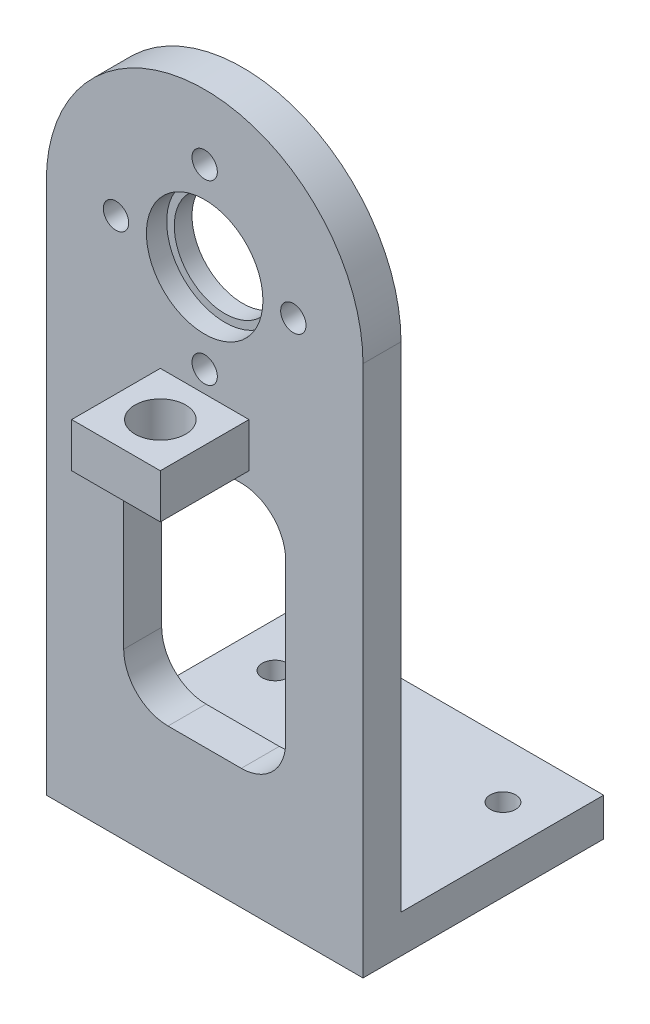
ISO-10303-21;
HEADER;
FILE_DESCRIPTION(('STEP AP214'),'2;1');
FILE_NAME('part.step','',(''),(''),'','','');
FILE_SCHEMA(('AUTOMOTIVE_DESIGN { 1 0 10303 214 1 1 1 1 }'));
ENDSEC;
DATA;
#1=APPLICATION_CONTEXT('core data for automotive mechanical design processes');
#2=APPLICATION_PROTOCOL_DEFINITION('international standard','automotive_design',2000,#1);
#3=PRODUCT_CONTEXT('',#1,'mechanical');
#4=PRODUCT('Part','Part','',(#3));
#5=PRODUCT_RELATED_PRODUCT_CATEGORY('part','',(#4));
#6=PRODUCT_DEFINITION_FORMATION('','',#4);
#7=PRODUCT_DEFINITION_CONTEXT('part definition',#1,'design');
#8=PRODUCT_DEFINITION('design','',#6,#7);
#9=PRODUCT_DEFINITION_SHAPE('','',#8);
#10=(LENGTH_UNIT() NAMED_UNIT(*) SI_UNIT(.MILLI.,.METRE.));
#11=(NAMED_UNIT(*) PLANE_ANGLE_UNIT() SI_UNIT($,.RADIAN.));
#12=(NAMED_UNIT(*) SI_UNIT($,.STERADIAN.) SOLID_ANGLE_UNIT());
#13=UNCERTAINTY_MEASURE_WITH_UNIT(LENGTH_MEASURE(1.E-05),#10,'distance_accuracy_value','');
#14=(GEOMETRIC_REPRESENTATION_CONTEXT(3) GLOBAL_UNCERTAINTY_ASSIGNED_CONTEXT((#13)) GLOBAL_UNIT_ASSIGNED_CONTEXT((#10,
#11,#12)) REPRESENTATION_CONTEXT('',''));
#15=CARTESIAN_POINT('',(0.,0.,0.));
#16=DIRECTION('',(0.,0.,1.));
#17=DIRECTION('',(1.,0.,0.));
#18=AXIS2_PLACEMENT_3D('',#15,#16,#17);
#19=CARTESIAN_POINT('',(0.,0.,3.));
#20=DIRECTION('',(0.,0.,1.));
#21=DIRECTION('',(1.,0.,0.));
#22=AXIS2_PLACEMENT_3D('',#19,#20,#21);
#23=PLANE('',#22);
#24=DIRECTION('',(1.,0.,0.));
#25=VECTOR('',#24,1.);
#26=CARTESIAN_POINT('',(0.,-14.5645587767016,3.));
#27=LINE('',#26,#25);
#28=CARTESIAN_POINT('',(-12.5,-14.5645587767016,3.));
#29=VERTEX_POINT('',#28);
#30=CARTESIAN_POINT('',(12.5,-14.5645587767016,3.));
#31=VERTEX_POINT('',#30);
#32=EDGE_CURVE('E293',#29,#31,#27,.T.);
#33=ORIENTED_EDGE('',*,*,#32,.T.);
#34=DIRECTION('',(0.,-1.,0.));
#35=VECTOR('',#34,1.);
#36=CARTESIAN_POINT('',(12.5,0.,3.));
#37=LINE('',#36,#35);
#38=CARTESIAN_POINT('',(12.5,27.4354412232984,3.));
#39=VERTEX_POINT('',#38);
#40=EDGE_CURVE('E286',#39,#31,#37,.T.);
#41=ORIENTED_EDGE('',*,*,#40,.F.);
#42=CARTESIAN_POINT('',(0.,27.4354412232984,3.));
#43=DIRECTION('',(0.,0.,1.));
#44=DIRECTION('',(1.,0.,0.));
#45=AXIS2_PLACEMENT_3D('',#42,#43,#44);
#46=CIRCLE('',#45,12.5);
#47=CARTESIAN_POINT('',(-12.5,27.4354412232984,3.));
#48=VERTEX_POINT('',#47);
#49=EDGE_CURVE('E288',#39,#48,#46,.T.);
#50=ORIENTED_EDGE('',*,*,#49,.T.);
#51=DIRECTION('',(0.,-1.,0.));
#52=VECTOR('',#51,1.);
#53=CARTESIAN_POINT('',(-12.5,0.,3.));
#54=LINE('',#53,#52);
#55=EDGE_CURVE('E291',#48,#29,#54,.T.);
#56=ORIENTED_EDGE('',*,*,#55,.T.);
#57=EDGE_LOOP('',(#33,#41,#50,#56));
#58=FACE_BOUND('',#57,.T.);
#59=CARTESIAN_POINT('',(0.,27.8020491594206,3.));
#60=DIRECTION('',(0.,0.,1.));
#61=DIRECTION('',(1.,0.,0.));
#62=AXIS2_PLACEMENT_3D('',#59,#60,#61);
#63=CIRCLE('',#62,4.6);
#64=CARTESIAN_POINT('',(4.6,27.8020491594206,3.));
#65=VERTEX_POINT('',#64);
#66=EDGE_CURVE('E249',#65,#65,#63,.T.);
#67=ORIENTED_EDGE('',*,*,#66,.F.);
#68=EDGE_LOOP('',(#67));
#69=FACE_BOUND('',#68,.T.);
#70=CARTESIAN_POINT('',(0.,20.8020491594206,3.));
#71=DIRECTION('',(0.,0.,1.));
#72=DIRECTION('',(1.,0.,0.));
#73=AXIS2_PLACEMENT_3D('',#70,#71,#72);
#74=CIRCLE('',#73,1.);
#75=CARTESIAN_POINT('',(1.,20.8020491594206,3.));
#76=VERTEX_POINT('',#75);
#77=EDGE_CURVE('E262',#76,#76,#74,.T.);
#78=ORIENTED_EDGE('',*,*,#77,.F.);
#79=EDGE_LOOP('',(#78));
#80=FACE_BOUND('',#79,.T.);
#81=CARTESIAN_POINT('',(-7.,27.8020491594206,3.));
#82=DIRECTION('',(0.,0.,1.));
#83=DIRECTION('',(1.,0.,0.));
#84=AXIS2_PLACEMENT_3D('',#81,#82,#83);
#85=CIRCLE('',#84,1.);
#86=CARTESIAN_POINT('',(-6.,27.8020491594206,3.));
#87=VERTEX_POINT('',#86);
#88=EDGE_CURVE('E275',#87,#87,#85,.T.);
#89=ORIENTED_EDGE('',*,*,#88,.F.);
#90=EDGE_LOOP('',(#89));
#91=FACE_BOUND('',#90,.T.);
#92=CARTESIAN_POINT('',(0.,34.8020491594206,3.));
#93=DIRECTION('',(0.,0.,1.));
#94=DIRECTION('',(1.,0.,0.));
#95=AXIS2_PLACEMENT_3D('',#92,#93,#94);
#96=CIRCLE('',#95,1.);
#97=CARTESIAN_POINT('',(1.,34.8020491594206,3.));
#98=VERTEX_POINT('',#97);
#99=EDGE_CURVE('E268',#98,#98,#96,.T.);
#100=ORIENTED_EDGE('',*,*,#99,.F.);
#101=EDGE_LOOP('',(#100));
#102=FACE_BOUND('',#101,.T.);
#103=CARTESIAN_POINT('',(7.,27.8020491594206,3.));
#104=DIRECTION('',(0.,0.,1.));
#105=DIRECTION('',(1.,0.,0.));
#106=AXIS2_PLACEMENT_3D('',#103,#104,#105);
#107=CIRCLE('',#106,1.);
#108=CARTESIAN_POINT('',(8.,27.8020491594206,3.));
#109=VERTEX_POINT('',#108);
#110=EDGE_CURVE('E271',#109,#109,#107,.T.);
#111=ORIENTED_EDGE('',*,*,#110,.F.);
#112=EDGE_LOOP('',(#111));
#113=FACE_BOUND('',#112,.T.);
#114=DIRECTION('',(0.,-1.,0.));
#115=VECTOR('',#114,1.);
#116=CARTESIAN_POINT('',(-6.39192660681687,0.,3.));
#117=LINE('',#116,#115);
#118=CARTESIAN_POINT('',(-6.39192660681687,10.9669786390167,3.));
#119=VERTEX_POINT('',#118);
#120=CARTESIAN_POINT('',(-6.39192660681687,-1.53302136098327,3.));
#121=VERTEX_POINT('',#120);
#122=EDGE_CURVE('E205',#119,#121,#117,.T.);
#123=ORIENTED_EDGE('',*,*,#122,.F.);
#124=CARTESIAN_POINT('',(-2.89192660681687,10.9669786390167,3.));
#125=DIRECTION('',(0.,0.,1.));
#126=DIRECTION('',(1.,0.,0.));
#127=AXIS2_PLACEMENT_3D('',#124,#125,#126);
#128=CIRCLE('',#127,3.5);
#129=CARTESIAN_POINT('',(-2.89192660681687,14.4669786390167,3.));
#130=VERTEX_POINT('',#129);
#131=EDGE_CURVE('E53',#119,#130,#128,.F.);
#132=ORIENTED_EDGE('',*,*,#131,.T.);
#133=DIRECTION('',(1.,0.,0.));
#134=VECTOR('',#133,1.);
#135=CARTESIAN_POINT('',(0.,14.4669786390167,3.));
#136=LINE('',#135,#134);
#137=CARTESIAN_POINT('',(2.89192660681686,14.4669786390167,3.));
#138=VERTEX_POINT('',#137);
#139=EDGE_CURVE('E198',#130,#138,#136,.T.);
#140=ORIENTED_EDGE('',*,*,#139,.T.);
#141=CARTESIAN_POINT('',(2.89192660681686,10.9669786390167,3.));
#142=DIRECTION('',(0.,0.,1.));
#143=DIRECTION('',(1.,0.,0.));
#144=AXIS2_PLACEMENT_3D('',#141,#142,#143);
#145=CIRCLE('',#144,3.5);
#146=CARTESIAN_POINT('',(6.39192660681686,10.9669786390167,3.));
#147=VERTEX_POINT('',#146);
#148=EDGE_CURVE('E68',#138,#147,#145,.F.);
#149=ORIENTED_EDGE('',*,*,#148,.T.);
#150=DIRECTION('',(0.,-1.,0.));
#151=VECTOR('',#150,1.);
#152=CARTESIAN_POINT('',(6.39192660681687,0.,3.));
#153=LINE('',#152,#151);
#154=CARTESIAN_POINT('',(6.39192660681687,-1.53302136098327,3.));
#155=VERTEX_POINT('',#154);
#156=EDGE_CURVE('E195',#147,#155,#153,.T.);
#157=ORIENTED_EDGE('',*,*,#156,.T.);
#158=CARTESIAN_POINT('',(2.89192660681687,-1.53302136098327,3.));
#159=DIRECTION('',(0.,0.,1.));
#160=DIRECTION('',(1.,0.,0.));
#161=AXIS2_PLACEMENT_3D('',#158,#159,#160);
#162=CIRCLE('',#161,3.5);
#163=CARTESIAN_POINT('',(2.89192660681687,-5.03302136098327,3.));
#164=VERTEX_POINT('',#163);
#165=EDGE_CURVE('E338',#155,#164,#162,.F.);
#166=ORIENTED_EDGE('',*,*,#165,.T.);
#167=DIRECTION('',(1.,0.,0.));
#168=VECTOR('',#167,1.);
#169=CARTESIAN_POINT('',(0.,-5.03302136098327,3.));
#170=LINE('',#169,#168);
#171=CARTESIAN_POINT('',(-2.89192660681687,-5.03302136098327,3.));
#172=VERTEX_POINT('',#171);
#173=EDGE_CURVE('E208',#172,#164,#170,.T.);
#174=ORIENTED_EDGE('',*,*,#173,.F.);
#175=CARTESIAN_POINT('',(-2.89192660681687,-1.53302136098327,3.));
#176=DIRECTION('',(0.,0.,1.));
#177=DIRECTION('',(1.,0.,0.));
#178=AXIS2_PLACEMENT_3D('',#175,#176,#177);
#179=CIRCLE('',#178,3.5);
#180=EDGE_CURVE('E334',#172,#121,#179,.F.);
#181=ORIENTED_EDGE('',*,*,#180,.T.);
#182=EDGE_LOOP('',(#123,#132,#140,#149,#157,#166,#174,#181));
#183=FACE_BOUND('',#182,.T.);
#184=DIRECTION('',(-1.,0.,0.));
#185=VECTOR('',#184,1.);
#186=CARTESIAN_POINT('',(-3.5,19.1154412232984,3.));
#187=LINE('',#186,#185);
#188=CARTESIAN_POINT('',(3.5,19.1154412232984,3.));
#189=VERTEX_POINT('',#188);
#190=CARTESIAN_POINT('',(-3.5,19.1154412232984,3.));
#191=VERTEX_POINT('',#190);
#192=EDGE_CURVE('E685',#189,#191,#187,.T.);
#193=ORIENTED_EDGE('',*,*,#192,.F.);
#194=DIRECTION('',(0.,1.,0.));
#195=VECTOR('',#194,1.);
#196=CARTESIAN_POINT('',(3.5,15.6154412232984,3.));
#197=LINE('',#196,#195);
#198=CARTESIAN_POINT('',(3.5,15.6154412232984,3.));
#199=VERTEX_POINT('',#198);
#200=EDGE_CURVE('E193',#199,#189,#197,.T.);
#201=ORIENTED_EDGE('',*,*,#200,.F.);
#202=DIRECTION('',(1.,0.,0.));
#203=VECTOR('',#202,1.);
#204=CARTESIAN_POINT('',(-3.5,15.6154412232984,3.));
#205=LINE('',#204,#203);
#206=CARTESIAN_POINT('',(-3.5,15.6154412232984,3.));
#207=VERTEX_POINT('',#206);
#208=EDGE_CURVE('E189',#207,#199,#205,.T.);
#209=ORIENTED_EDGE('',*,*,#208,.F.);
#210=DIRECTION('',(0.,-1.,0.));
#211=VECTOR('',#210,1.);
#212=CARTESIAN_POINT('',(-3.5,15.6154412232984,3.));
#213=LINE('',#212,#211);
#214=EDGE_CURVE('E693',#191,#207,#213,.T.);
#215=ORIENTED_EDGE('',*,*,#214,.F.);
#216=EDGE_LOOP('',(#193,#201,#209,#215));
#217=FACE_BOUND('',#216,.T.);
#218=ADVANCED_FACE('F44',(#58,#69,#80,#91,#102,#113,#183,#217),#23,.T.);
#219=CARTESIAN_POINT('',(0.,0.,0.));
#220=DIRECTION('',(0.,0.,1.));
#221=DIRECTION('',(1.,0.,0.));
#222=AXIS2_PLACEMENT_3D('',#219,#220,#221);
#223=PLANE('',#222);
#224=DIRECTION('',(1.,0.,0.));
#225=VECTOR('',#224,1.);
#226=CARTESIAN_POINT('',(0.,-11.5645587767016,0.));
#227=LINE('',#226,#225);
#228=CARTESIAN_POINT('',(-12.5,-11.5645587767016,0.));
#229=VERTEX_POINT('',#228);
#230=CARTESIAN_POINT('',(12.5,-11.5645587767016,0.));
#231=VERTEX_POINT('',#230);
#232=EDGE_CURVE('E311',#229,#231,#227,.T.);
#233=ORIENTED_EDGE('',*,*,#232,.F.);
#234=DIRECTION('',(0.,-1.,0.));
#235=VECTOR('',#234,1.);
#236=CARTESIAN_POINT('',(-12.5,0.,0.));
#237=LINE('',#236,#235);
#238=CARTESIAN_POINT('',(-12.5,27.4354412232984,0.));
#239=VERTEX_POINT('',#238);
#240=EDGE_CURVE('E289',#239,#229,#237,.T.);
#241=ORIENTED_EDGE('',*,*,#240,.F.);
#242=CARTESIAN_POINT('',(0.,27.4354412232984,0.));
#243=DIRECTION('',(0.,0.,1.));
#244=DIRECTION('',(1.,0.,0.));
#245=AXIS2_PLACEMENT_3D('',#242,#243,#244);
#246=CIRCLE('',#245,12.5);
#247=CARTESIAN_POINT('',(12.5,27.4354412232984,0.));
#248=VERTEX_POINT('',#247);
#249=EDGE_CURVE('E299',#248,#239,#246,.T.);
#250=ORIENTED_EDGE('',*,*,#249,.F.);
#251=DIRECTION('',(0.,-1.,0.));
#252=VECTOR('',#251,1.);
#253=CARTESIAN_POINT('',(12.5,0.,0.));
#254=LINE('',#253,#252);
#255=EDGE_CURVE('E283',#248,#231,#254,.T.);
#256=ORIENTED_EDGE('',*,*,#255,.T.);
#257=EDGE_LOOP('',(#233,#241,#250,#256));
#258=FACE_BOUND('',#257,.T.);
#259=CARTESIAN_POINT('',(0.,20.8020491594206,0.));
#260=DIRECTION('',(0.,0.,1.));
#261=DIRECTION('',(1.,0.,0.));
#262=AXIS2_PLACEMENT_3D('',#259,#260,#261);
#263=CIRCLE('',#262,1.);
#264=CARTESIAN_POINT('',(1.,20.8020491594206,0.));
#265=VERTEX_POINT('',#264);
#266=EDGE_CURVE('E265',#265,#265,#263,.T.);
#267=ORIENTED_EDGE('',*,*,#266,.T.);
#268=EDGE_LOOP('',(#267));
#269=FACE_BOUND('',#268,.T.);
#270=CARTESIAN_POINT('',(0.,27.8020491594206,0.));
#271=DIRECTION('',(0.,0.,1.));
#272=DIRECTION('',(1.,0.,0.));
#273=AXIS2_PLACEMENT_3D('',#270,#271,#272);
#274=CIRCLE('',#273,4.);
#275=CARTESIAN_POINT('',(4.,27.8020491594206,0.));
#276=VERTEX_POINT('',#275);
#277=EDGE_CURVE('E258',#276,#276,#274,.T.);
#278=ORIENTED_EDGE('',*,*,#277,.T.);
#279=EDGE_LOOP('',(#278));
#280=FACE_BOUND('',#279,.T.);
#281=CARTESIAN_POINT('',(-7.,27.8020491594206,0.));
#282=DIRECTION('',(0.,0.,1.));
#283=DIRECTION('',(1.,0.,0.));
#284=AXIS2_PLACEMENT_3D('',#281,#282,#283);
#285=CIRCLE('',#284,1.);
#286=CARTESIAN_POINT('',(-6.,27.8020491594206,0.));
#287=VERTEX_POINT('',#286);
#288=EDGE_CURVE('E261',#287,#287,#285,.T.);
#289=ORIENTED_EDGE('',*,*,#288,.T.);
#290=EDGE_LOOP('',(#289));
#291=FACE_BOUND('',#290,.T.);
#292=CARTESIAN_POINT('',(0.,34.8020491594206,0.));
#293=DIRECTION('',(0.,0.,1.));
#294=DIRECTION('',(1.,0.,0.));
#295=AXIS2_PLACEMENT_3D('',#292,#293,#294);
#296=CIRCLE('',#295,1.);
#297=CARTESIAN_POINT('',(1.,34.8020491594206,0.));
#298=VERTEX_POINT('',#297);
#299=EDGE_CURVE('E272',#298,#298,#296,.T.);
#300=ORIENTED_EDGE('',*,*,#299,.T.);
#301=EDGE_LOOP('',(#300));
#302=FACE_BOUND('',#301,.T.);
#303=CARTESIAN_POINT('',(7.,27.8020491594206,0.));
#304=DIRECTION('',(0.,0.,1.));
#305=DIRECTION('',(1.,0.,0.));
#306=AXIS2_PLACEMENT_3D('',#303,#304,#305);
#307=CIRCLE('',#306,1.);
#308=CARTESIAN_POINT('',(8.,27.8020491594206,0.));
#309=VERTEX_POINT('',#308);
#310=EDGE_CURVE('E280',#309,#309,#307,.T.);
#311=ORIENTED_EDGE('',*,*,#310,.T.);
#312=EDGE_LOOP('',(#311));
#313=FACE_BOUND('',#312,.T.);
#314=DIRECTION('',(0.,-1.,0.));
#315=VECTOR('',#314,1.);
#316=CARTESIAN_POINT('',(6.39192660681687,0.,0.));
#317=LINE('',#316,#315);
#318=CARTESIAN_POINT('',(6.39192660681686,10.9669786390167,0.));
#319=VERTEX_POINT('',#318);
#320=CARTESIAN_POINT('',(6.39192660681687,-1.53302136098327,0.));
#321=VERTEX_POINT('',#320);
#322=EDGE_CURVE('E220',#319,#321,#317,.T.);
#323=ORIENTED_EDGE('',*,*,#322,.F.);
#324=CARTESIAN_POINT('',(2.89192660681686,10.9669786390167,0.));
#325=DIRECTION('',(0.,0.,1.));
#326=DIRECTION('',(1.,0.,0.));
#327=AXIS2_PLACEMENT_3D('',#324,#325,#326);
#328=CIRCLE('',#327,3.5);
#329=CARTESIAN_POINT('',(2.89192660681686,14.4669786390167,0.));
#330=VERTEX_POINT('',#329);
#331=EDGE_CURVE('E343',#319,#330,#328,.T.);
#332=ORIENTED_EDGE('',*,*,#331,.T.);
#333=DIRECTION('',(1.,0.,0.));
#334=VECTOR('',#333,1.);
#335=CARTESIAN_POINT('',(0.,14.4669786390167,0.));
#336=LINE('',#335,#334);
#337=CARTESIAN_POINT('',(-2.89192660681687,14.4669786390167,0.));
#338=VERTEX_POINT('',#337);
#339=EDGE_CURVE('E211',#338,#330,#336,.T.);
#340=ORIENTED_EDGE('',*,*,#339,.F.);
#341=CARTESIAN_POINT('',(-2.89192660681687,10.9669786390167,0.));
#342=DIRECTION('',(0.,0.,1.));
#343=DIRECTION('',(1.,0.,0.));
#344=AXIS2_PLACEMENT_3D('',#341,#342,#343);
#345=CIRCLE('',#344,3.5);
#346=CARTESIAN_POINT('',(-6.39192660681687,10.9669786390167,0.));
#347=VERTEX_POINT('',#346);
#348=EDGE_CURVE('E12',#338,#347,#345,.T.);
#349=ORIENTED_EDGE('',*,*,#348,.T.);
#350=DIRECTION('',(0.,-1.,0.));
#351=VECTOR('',#350,1.);
#352=CARTESIAN_POINT('',(-6.39192660681687,0.,0.));
#353=LINE('',#352,#351);
#354=CARTESIAN_POINT('',(-6.39192660681687,-1.53302136098327,0.));
#355=VERTEX_POINT('',#354);
#356=EDGE_CURVE('E214',#347,#355,#353,.T.);
#357=ORIENTED_EDGE('',*,*,#356,.T.);
#358=CARTESIAN_POINT('',(-2.89192660681687,-1.53302136098327,0.));
#359=DIRECTION('',(0.,0.,1.));
#360=DIRECTION('',(1.,0.,0.));
#361=AXIS2_PLACEMENT_3D('',#358,#359,#360);
#362=CIRCLE('',#361,3.5);
#363=CARTESIAN_POINT('',(-2.89192660681687,-5.03302136098327,0.));
#364=VERTEX_POINT('',#363);
#365=EDGE_CURVE('E336',#355,#364,#362,.T.);
#366=ORIENTED_EDGE('',*,*,#365,.T.);
#367=DIRECTION('',(1.,0.,0.));
#368=VECTOR('',#367,1.);
#369=CARTESIAN_POINT('',(0.,-5.03302136098327,0.));
#370=LINE('',#369,#368);
#371=CARTESIAN_POINT('',(2.89192660681687,-5.03302136098327,0.));
#372=VERTEX_POINT('',#371);
#373=EDGE_CURVE('E217',#364,#372,#370,.T.);
#374=ORIENTED_EDGE('',*,*,#373,.T.);
#375=CARTESIAN_POINT('',(2.89192660681687,-1.53302136098327,0.));
#376=DIRECTION('',(0.,0.,1.));
#377=DIRECTION('',(1.,0.,0.));
#378=AXIS2_PLACEMENT_3D('',#375,#376,#377);
#379=CIRCLE('',#378,3.5);
#380=EDGE_CURVE('E340',#372,#321,#379,.T.);
#381=ORIENTED_EDGE('',*,*,#380,.T.);
#382=EDGE_LOOP('',(#323,#332,#340,#349,#357,#366,#374,#381));
#383=FACE_BOUND('',#382,.T.);
#384=ADVANCED_FACE('F359',(#258,#269,#280,#291,#302,#313,#383),#223,.F.);
#385=CARTESIAN_POINT('',(0.,27.8020491594206,0.));
#386=DIRECTION('',(0.,0.,1.));
#387=DIRECTION('',(1.,0.,0.));
#388=AXIS2_PLACEMENT_3D('',#385,#386,#387);
#389=CYLINDRICAL_SURFACE('',#388,4.);
#390=ORIENTED_EDGE('',*,*,#277,.F.);
#391=EDGE_LOOP('',(#390));
#392=FACE_BOUND('',#391,.T.);
#393=CARTESIAN_POINT('',(0.,27.8020491594206,1.4));
#394=DIRECTION('',(0.,0.,1.));
#395=DIRECTION('',(1.,0.,0.));
#396=AXIS2_PLACEMENT_3D('',#393,#394,#395);
#397=CIRCLE('',#396,4.);
#398=CARTESIAN_POINT('',(4.,27.8020491594206,1.4));
#399=VERTEX_POINT('',#398);
#400=EDGE_CURVE('E255',#399,#399,#397,.F.);
#401=ORIENTED_EDGE('',*,*,#400,.F.);
#402=EDGE_LOOP('',(#401));
#403=FACE_BOUND('',#402,.T.);
#404=ADVANCED_FACE('F393',(#392,#403),#389,.F.);
#405=CARTESIAN_POINT('',(12.5,0.,3.));
#406=DIRECTION('',(1.,0.,0.));
#407=DIRECTION('',(0.,1.,0.));
#408=AXIS2_PLACEMENT_3D('',#405,#406,#407);
#409=PLANE('',#408);
#410=DIRECTION('',(0.,0.,1.));
#411=VECTOR('',#410,1.);
#412=CARTESIAN_POINT('',(12.5,-11.5645587767016,-16.));
#413=LINE('',#412,#411);
#414=CARTESIAN_POINT('',(12.5,-11.5645587767016,-16.));
#415=VERTEX_POINT('',#414);
#416=EDGE_CURVE('E246',#415,#231,#413,.T.);
#417=ORIENTED_EDGE('',*,*,#416,.T.);
#418=ORIENTED_EDGE('',*,*,#255,.F.);
#419=DIRECTION('',(0.,0.,-1.));
#420=VECTOR('',#419,1.);
#421=CARTESIAN_POINT('',(12.5,27.4354412232984,3.));
#422=LINE('',#421,#420);
#423=EDGE_CURVE('E309',#39,#248,#422,.T.);
#424=ORIENTED_EDGE('',*,*,#423,.F.);
#425=ORIENTED_EDGE('',*,*,#40,.T.);
#426=DIRECTION('',(0.,0.,-1.));
#427=VECTOR('',#426,1.);
#428=CARTESIAN_POINT('',(12.5,-14.5645587767016,3.));
#429=LINE('',#428,#427);
#430=CARTESIAN_POINT('',(12.5,-14.5645587767016,-16.));
#431=VERTEX_POINT('',#430);
#432=EDGE_CURVE('E296',#31,#431,#429,.T.);
#433=ORIENTED_EDGE('',*,*,#432,.T.);
#434=DIRECTION('',(0.,1.,0.));
#435=VECTOR('',#434,1.);
#436=CARTESIAN_POINT('',(12.5,-14.5645587767016,-16.));
#437=LINE('',#436,#435);
#438=EDGE_CURVE('E241',#431,#415,#437,.T.);
#439=ORIENTED_EDGE('',*,*,#438,.T.);
#440=EDGE_LOOP('',(#417,#418,#424,#425,#433,#439));
#441=FACE_BOUND('',#440,.T.);
#442=ADVANCED_FACE('F412',(#441),#409,.T.);
#443=CARTESIAN_POINT('',(0.,27.4354412232984,3.));
#444=DIRECTION('',(0.,0.,-1.));
#445=DIRECTION('',(-1.,0.,0.));
#446=AXIS2_PLACEMENT_3D('',#443,#444,#445);
#447=CYLINDRICAL_SURFACE('',#446,12.5);
#448=ORIENTED_EDGE('',*,*,#249,.T.);
#449=DIRECTION('',(0.,0.,-1.));
#450=VECTOR('',#449,1.);
#451=CARTESIAN_POINT('',(-12.5,27.4354412232984,3.));
#452=LINE('',#451,#450);
#453=EDGE_CURVE('E306',#48,#239,#452,.T.);
#454=ORIENTED_EDGE('',*,*,#453,.F.);
#455=ORIENTED_EDGE('',*,*,#49,.F.);
#456=ORIENTED_EDGE('',*,*,#423,.T.);
#457=EDGE_LOOP('',(#448,#454,#455,#456));
#458=FACE_BOUND('',#457,.T.);
#459=ADVANCED_FACE('F408',(#458),#447,.T.);
#460=CARTESIAN_POINT('',(-12.5,0.,3.));
#461=DIRECTION('',(1.,0.,0.));
#462=DIRECTION('',(0.,1.,0.));
#463=AXIS2_PLACEMENT_3D('',#460,#461,#462);
#464=PLANE('',#463);
#465=DIRECTION('',(0.,0.,-1.));
#466=VECTOR('',#465,1.);
#467=CARTESIAN_POINT('',(-12.5,-14.5645587767016,3.));
#468=LINE('',#467,#466);
#469=CARTESIAN_POINT('',(-12.5,-14.5645587767016,-16.));
#470=VERTEX_POINT('',#469);
#471=EDGE_CURVE('E304',#29,#470,#468,.T.);
#472=ORIENTED_EDGE('',*,*,#471,.F.);
#473=ORIENTED_EDGE('',*,*,#55,.F.);
#474=ORIENTED_EDGE('',*,*,#453,.T.);
#475=ORIENTED_EDGE('',*,*,#240,.T.);
#476=DIRECTION('',(0.,0.,1.));
#477=VECTOR('',#476,1.);
#478=CARTESIAN_POINT('',(-12.5,-11.5645587767016,-16.));
#479=LINE('',#478,#477);
#480=CARTESIAN_POINT('',(-12.5,-11.5645587767016,-16.));
#481=VERTEX_POINT('',#480);
#482=EDGE_CURVE('E247',#481,#229,#479,.T.);
#483=ORIENTED_EDGE('',*,*,#482,.F.);
#484=DIRECTION('',(0.,-1.,0.));
#485=VECTOR('',#484,1.);
#486=CARTESIAN_POINT('',(-12.5,-11.5645587767016,-16.));
#487=LINE('',#486,#485);
#488=EDGE_CURVE('E235',#481,#470,#487,.T.);
#489=ORIENTED_EDGE('',*,*,#488,.T.);
#490=EDGE_LOOP('',(#472,#473,#474,#475,#483,#489));
#491=FACE_BOUND('',#490,.T.);
#492=ADVANCED_FACE('F404',(#491),#464,.F.);
#493=CARTESIAN_POINT('',(0.,-14.5645587767016,3.));
#494=DIRECTION('',(0.,1.,0.));
#495=DIRECTION('',(-1.,0.,0.));
#496=AXIS2_PLACEMENT_3D('',#493,#494,#495);
#497=PLANE('',#496);
#498=CARTESIAN_POINT('',(-9.,-14.5645587767016,-11.55));
#499=DIRECTION('',(0.,1.,0.));
#500=DIRECTION('',(-1.,0.,0.));
#501=AXIS2_PLACEMENT_3D('',#498,#499,#500);
#502=CIRCLE('',#501,0.999999999999999);
#503=CARTESIAN_POINT('',(-10.,-14.5645587767016,-11.55));
#504=VERTEX_POINT('',#503);
#505=EDGE_CURVE('E226',#504,#504,#502,.T.);
#506=ORIENTED_EDGE('',*,*,#505,.T.);
#507=EDGE_LOOP('',(#506));
#508=FACE_BOUND('',#507,.T.);
#509=CARTESIAN_POINT('',(9.,-14.5645587767016,-11.55));
#510=DIRECTION('',(0.,1.,0.));
#511=DIRECTION('',(-1.,0.,0.));
#512=AXIS2_PLACEMENT_3D('',#509,#510,#511);
#513=CIRCLE('',#512,1.);
#514=CARTESIAN_POINT('',(8.,-14.5645587767016,-11.55));
#515=VERTEX_POINT('',#514);
#516=EDGE_CURVE('E232',#515,#515,#513,.T.);
#517=ORIENTED_EDGE('',*,*,#516,.T.);
#518=EDGE_LOOP('',(#517));
#519=FACE_BOUND('',#518,.T.);
#520=ORIENTED_EDGE('',*,*,#471,.T.);
#521=DIRECTION('',(1.,0.,0.));
#522=VECTOR('',#521,1.);
#523=CARTESIAN_POINT('',(-12.5,-14.5645587767016,-16.));
#524=LINE('',#523,#522);
#525=EDGE_CURVE('E238',#470,#431,#524,.T.);
#526=ORIENTED_EDGE('',*,*,#525,.T.);
#527=ORIENTED_EDGE('',*,*,#432,.F.);
#528=ORIENTED_EDGE('',*,*,#32,.F.);
#529=EDGE_LOOP('',(#520,#526,#527,#528));
#530=FACE_BOUND('',#529,.T.);
#531=ADVANCED_FACE('F401',(#508,#519,#530),#497,.F.);
#532=CARTESIAN_POINT('',(7.,27.8020491594206,0.));
#533=DIRECTION('',(0.,0.,1.));
#534=DIRECTION('',(1.,0.,0.));
#535=AXIS2_PLACEMENT_3D('',#532,#533,#534);
#536=CYLINDRICAL_SURFACE('',#535,1.);
#537=ORIENTED_EDGE('',*,*,#310,.F.);
#538=EDGE_LOOP('',(#537));
#539=FACE_BOUND('',#538,.T.);
#540=ORIENTED_EDGE('',*,*,#110,.T.);
#541=EDGE_LOOP('',(#540));
#542=FACE_BOUND('',#541,.T.);
#543=ADVANCED_FACE('F398',(#539,#542),#536,.F.);
#544=CARTESIAN_POINT('',(0.,34.8020491594206,0.));
#545=DIRECTION('',(0.,0.,1.));
#546=DIRECTION('',(1.,0.,0.));
#547=AXIS2_PLACEMENT_3D('',#544,#545,#546);
#548=CYLINDRICAL_SURFACE('',#547,1.);
#549=ORIENTED_EDGE('',*,*,#299,.F.);
#550=EDGE_LOOP('',(#549));
#551=FACE_BOUND('',#550,.T.);
#552=ORIENTED_EDGE('',*,*,#99,.T.);
#553=EDGE_LOOP('',(#552));
#554=FACE_BOUND('',#553,.T.);
#555=ADVANCED_FACE('F462',(#551,#554),#548,.F.);
#556=CARTESIAN_POINT('',(-7.,27.8020491594206,0.));
#557=DIRECTION('',(0.,0.,1.));
#558=DIRECTION('',(1.,0.,0.));
#559=AXIS2_PLACEMENT_3D('',#556,#557,#558);
#560=CYLINDRICAL_SURFACE('',#559,1.);
#561=ORIENTED_EDGE('',*,*,#288,.F.);
#562=EDGE_LOOP('',(#561));
#563=FACE_BOUND('',#562,.T.);
#564=ORIENTED_EDGE('',*,*,#88,.T.);
#565=EDGE_LOOP('',(#564));
#566=FACE_BOUND('',#565,.T.);
#567=ADVANCED_FACE('F460',(#563,#566),#560,.F.);
#568=CARTESIAN_POINT('',(0.,20.8020491594206,0.));
#569=DIRECTION('',(0.,0.,1.));
#570=DIRECTION('',(1.,0.,0.));
#571=AXIS2_PLACEMENT_3D('',#568,#569,#570);
#572=CYLINDRICAL_SURFACE('',#571,1.);
#573=ORIENTED_EDGE('',*,*,#77,.T.);
#574=EDGE_LOOP('',(#573));
#575=FACE_BOUND('',#574,.T.);
#576=ORIENTED_EDGE('',*,*,#266,.F.);
#577=EDGE_LOOP('',(#576));
#578=FACE_BOUND('',#577,.T.);
#579=ADVANCED_FACE('F450',(#575,#578),#572,.F.);
#580=CARTESIAN_POINT('',(0.,27.8020491594206,1.4));
#581=DIRECTION('',(0.,0.,1.));
#582=DIRECTION('',(1.,0.,0.));
#583=AXIS2_PLACEMENT_3D('',#580,#581,#582);
#584=PLANE('',#583);
#585=CARTESIAN_POINT('',(0.,27.8020491594206,1.4));
#586=DIRECTION('',(0.,0.,1.));
#587=DIRECTION('',(1.,0.,0.));
#588=AXIS2_PLACEMENT_3D('',#585,#586,#587);
#589=CIRCLE('',#588,4.6);
#590=CARTESIAN_POINT('',(4.6,27.8020491594206,1.4));
#591=VERTEX_POINT('',#590);
#592=EDGE_CURVE('E252',#591,#591,#589,.T.);
#593=ORIENTED_EDGE('',*,*,#592,.T.);
#594=EDGE_LOOP('',(#593));
#595=FACE_BOUND('',#594,.T.);
#596=ORIENTED_EDGE('',*,*,#400,.T.);
#597=EDGE_LOOP('',(#596));
#598=FACE_BOUND('',#597,.T.);
#599=ADVANCED_FACE('F447',(#595,#598),#584,.T.);
#600=CARTESIAN_POINT('',(0.,27.8020491594206,1.4));
#601=DIRECTION('',(0.,0.,1.));
#602=DIRECTION('',(1.,0.,0.));
#603=AXIS2_PLACEMENT_3D('',#600,#601,#602);
#604=CYLINDRICAL_SURFACE('',#603,4.6);
#605=ORIENTED_EDGE('',*,*,#592,.F.);
#606=EDGE_LOOP('',(#605));
#607=FACE_BOUND('',#606,.T.);
#608=ORIENTED_EDGE('',*,*,#66,.T.);
#609=EDGE_LOOP('',(#608));
#610=FACE_BOUND('',#609,.T.);
#611=ADVANCED_FACE('F445',(#607,#610),#604,.F.);
#612=CARTESIAN_POINT('',(-12.5,-11.5645587767016,-16.));
#613=DIRECTION('',(0.,-1.,0.));
#614=DIRECTION('',(0.,0.,-1.));
#615=AXIS2_PLACEMENT_3D('',#612,#613,#614);
#616=PLANE('',#615);
#617=CARTESIAN_POINT('',(-9.,-11.5645587767016,-11.55));
#618=DIRECTION('',(0.,1.,0.));
#619=DIRECTION('',(0.,0.,1.));
#620=AXIS2_PLACEMENT_3D('',#617,#618,#619);
#621=CIRCLE('',#620,0.999999999999999);
#622=CARTESIAN_POINT('',(-9.,-11.5645587767016,-10.55));
#623=VERTEX_POINT('',#622);
#624=EDGE_CURVE('E223',#623,#623,#621,.T.);
#625=ORIENTED_EDGE('',*,*,#624,.F.);
#626=EDGE_LOOP('',(#625));
#627=FACE_BOUND('',#626,.T.);
#628=CARTESIAN_POINT('',(9.,-11.5645587767016,-11.55));
#629=DIRECTION('',(0.,1.,0.));
#630=DIRECTION('',(0.,0.,1.));
#631=AXIS2_PLACEMENT_3D('',#628,#629,#630);
#632=CIRCLE('',#631,1.);
#633=CARTESIAN_POINT('',(9.,-11.5645587767016,-10.55));
#634=VERTEX_POINT('',#633);
#635=EDGE_CURVE('E229',#634,#634,#632,.T.);
#636=ORIENTED_EDGE('',*,*,#635,.F.);
#637=EDGE_LOOP('',(#636));
#638=FACE_BOUND('',#637,.T.);
#639=ORIENTED_EDGE('',*,*,#482,.T.);
#640=ORIENTED_EDGE('',*,*,#232,.T.);
#641=ORIENTED_EDGE('',*,*,#416,.F.);
#642=DIRECTION('',(1.,0.,0.));
#643=VECTOR('',#642,1.);
#644=CARTESIAN_POINT('',(-12.5,-11.5645587767016,-16.));
#645=LINE('',#644,#643);
#646=EDGE_CURVE('E244',#481,#415,#645,.T.);
#647=ORIENTED_EDGE('',*,*,#646,.F.);
#648=EDGE_LOOP('',(#639,#640,#641,#647));
#649=FACE_BOUND('',#648,.T.);
#650=ADVANCED_FACE('F441',(#627,#638,#649),#616,.F.);
#651=CARTESIAN_POINT('',(0.,0.,-16.));
#652=DIRECTION('',(0.,0.,1.));
#653=DIRECTION('',(1.,0.,0.));
#654=AXIS2_PLACEMENT_3D('',#651,#652,#653);
#655=PLANE('',#654);
#656=ORIENTED_EDGE('',*,*,#488,.F.);
#657=ORIENTED_EDGE('',*,*,#646,.T.);
#658=ORIENTED_EDGE('',*,*,#438,.F.);
#659=ORIENTED_EDGE('',*,*,#525,.F.);
#660=EDGE_LOOP('',(#656,#657,#658,#659));
#661=FACE_BOUND('',#660,.T.);
#662=ADVANCED_FACE('F437',(#661),#655,.F.);
#663=CARTESIAN_POINT('',(9.,-15.5645587767016,-11.55));
#664=DIRECTION('',(0.,1.,0.));
#665=DIRECTION('',(0.,0.,1.));
#666=AXIS2_PLACEMENT_3D('',#663,#664,#665);
#667=CYLINDRICAL_SURFACE('',#666,1.);
#668=ORIENTED_EDGE('',*,*,#635,.T.);
#669=EDGE_LOOP('',(#668));
#670=FACE_BOUND('',#669,.T.);
#671=ORIENTED_EDGE('',*,*,#516,.F.);
#672=EDGE_LOOP('',(#671));
#673=FACE_BOUND('',#672,.T.);
#674=ADVANCED_FACE('F433',(#670,#673),#667,.F.);
#675=CARTESIAN_POINT('',(-9.,-15.5645587767016,-11.55));
#676=DIRECTION('',(0.,1.,0.));
#677=DIRECTION('',(0.,0.,1.));
#678=AXIS2_PLACEMENT_3D('',#675,#676,#677);
#679=CYLINDRICAL_SURFACE('',#678,0.999999999999999);
#680=ORIENTED_EDGE('',*,*,#624,.T.);
#681=EDGE_LOOP('',(#680));
#682=FACE_BOUND('',#681,.T.);
#683=ORIENTED_EDGE('',*,*,#505,.F.);
#684=EDGE_LOOP('',(#683));
#685=FACE_BOUND('',#684,.T.);
#686=ADVANCED_FACE('F430',(#682,#685),#679,.F.);
#687=CARTESIAN_POINT('',(6.39192660681687,0.,-1.));
#688=DIRECTION('',(-1.,0.,0.));
#689=DIRECTION('',(0.,-1.,0.));
#690=AXIS2_PLACEMENT_3D('',#687,#688,#689);
#691=PLANE('',#690);
#692=ORIENTED_EDGE('',*,*,#322,.T.);
#693=DIRECTION('',(0.,0.,1.));
#694=VECTOR('',#693,1.);
#695=CARTESIAN_POINT('',(6.39192660681687,-1.53302136098327,-1.));
#696=LINE('',#695,#694);
#697=EDGE_CURVE('E327',#321,#155,#696,.T.);
#698=ORIENTED_EDGE('',*,*,#697,.T.);
#699=ORIENTED_EDGE('',*,*,#156,.F.);
#700=DIRECTION('',(0.,0.,1.));
#701=VECTOR('',#700,1.);
#702=CARTESIAN_POINT('',(6.39192660681686,10.9669786390167,0.));
#703=LINE('',#702,#701);
#704=EDGE_CURVE('E325',#147,#319,#703,.F.);
#705=ORIENTED_EDGE('',*,*,#704,.T.);
#706=EDGE_LOOP('',(#692,#698,#699,#705));
#707=FACE_BOUND('',#706,.T.);
#708=ADVANCED_FACE('F378',(#707),#691,.T.);
#709=CARTESIAN_POINT('',(0.,-5.03302136098327,-1.));
#710=DIRECTION('',(0.,-1.,0.));
#711=DIRECTION('',(0.,0.,-1.));
#712=AXIS2_PLACEMENT_3D('',#709,#710,#711);
#713=PLANE('',#712);
#714=ORIENTED_EDGE('',*,*,#373,.F.);
#715=DIRECTION('',(0.,0.,1.));
#716=VECTOR('',#715,1.);
#717=CARTESIAN_POINT('',(-2.89192660681687,-5.03302136098327,3.));
#718=LINE('',#717,#716);
#719=EDGE_CURVE('E317',#364,#172,#718,.T.);
#720=ORIENTED_EDGE('',*,*,#719,.T.);
#721=ORIENTED_EDGE('',*,*,#173,.T.);
#722=DIRECTION('',(0.,0.,1.));
#723=VECTOR('',#722,1.);
#724=CARTESIAN_POINT('',(2.89192660681687,-5.03302136098327,-1.));
#725=LINE('',#724,#723);
#726=EDGE_CURVE('E315',#164,#372,#725,.F.);
#727=ORIENTED_EDGE('',*,*,#726,.T.);
#728=EDGE_LOOP('',(#714,#720,#721,#727));
#729=FACE_BOUND('',#728,.T.);
#730=ADVANCED_FACE('F370',(#729),#713,.F.);
#731=CARTESIAN_POINT('',(-6.39192660681687,0.,-1.));
#732=DIRECTION('',(-1.,0.,0.));
#733=DIRECTION('',(0.,-1.,0.));
#734=AXIS2_PLACEMENT_3D('',#731,#732,#733);
#735=PLANE('',#734);
#736=ORIENTED_EDGE('',*,*,#122,.T.);
#737=DIRECTION('',(0.,0.,1.));
#738=VECTOR('',#737,1.);
#739=CARTESIAN_POINT('',(-6.39192660681687,-1.53302136098327,0.));
#740=LINE('',#739,#738);
#741=EDGE_CURVE('E323',#121,#355,#740,.F.);
#742=ORIENTED_EDGE('',*,*,#741,.T.);
#743=ORIENTED_EDGE('',*,*,#356,.F.);
#744=DIRECTION('',(0.,0.,1.));
#745=VECTOR('',#744,1.);
#746=CARTESIAN_POINT('',(-6.39192660681687,10.9669786390167,-1.));
#747=LINE('',#746,#745);
#748=EDGE_CURVE('E320',#347,#119,#747,.T.);
#749=ORIENTED_EDGE('',*,*,#748,.T.);
#750=EDGE_LOOP('',(#736,#742,#743,#749));
#751=FACE_BOUND('',#750,.T.);
#752=ADVANCED_FACE('F362',(#751),#735,.F.);
#753=CARTESIAN_POINT('',(0.,14.4669786390167,-1.));
#754=DIRECTION('',(0.,-1.,0.));
#755=DIRECTION('',(0.,0.,-1.));
#756=AXIS2_PLACEMENT_3D('',#753,#754,#755);
#757=PLANE('',#756);
#758=ORIENTED_EDGE('',*,*,#339,.T.);
#759=DIRECTION('',(0.,0.,1.));
#760=VECTOR('',#759,1.);
#761=CARTESIAN_POINT('',(2.89192660681686,14.4669786390167,3.));
#762=LINE('',#761,#760);
#763=EDGE_CURVE('E332',#330,#138,#762,.T.);
#764=ORIENTED_EDGE('',*,*,#763,.T.);
#765=ORIENTED_EDGE('',*,*,#139,.F.);
#766=DIRECTION('',(0.,0.,1.));
#767=VECTOR('',#766,1.);
#768=CARTESIAN_POINT('',(-2.89192660681687,14.4669786390167,-1.));
#769=LINE('',#768,#767);
#770=EDGE_CURVE('E330',#130,#338,#769,.F.);
#771=ORIENTED_EDGE('',*,*,#770,.T.);
#772=EDGE_LOOP('',(#758,#764,#765,#771));
#773=FACE_BOUND('',#772,.T.);
#774=ADVANCED_FACE('F353',(#773),#757,.T.);
#775=CARTESIAN_POINT('',(-2.89192660681687,-1.53302136098327,-1.));
#776=DIRECTION('',(0.,0.,-1.));
#777=DIRECTION('',(-1.,0.,0.));
#778=AXIS2_PLACEMENT_3D('',#775,#776,#777);
#779=CYLINDRICAL_SURFACE('',#778,3.5);
#780=ORIENTED_EDGE('',*,*,#365,.F.);
#781=ORIENTED_EDGE('',*,*,#741,.F.);
#782=ORIENTED_EDGE('',*,*,#180,.F.);
#783=ORIENTED_EDGE('',*,*,#719,.F.);
#784=EDGE_LOOP('',(#780,#781,#782,#783));
#785=FACE_BOUND('',#784,.T.);
#786=ADVANCED_FACE('F365',(#785),#779,.F.);
#787=CARTESIAN_POINT('',(2.89192660681687,-1.53302136098327,-1.));
#788=DIRECTION('',(0.,0.,1.));
#789=DIRECTION('',(1.,0.,0.));
#790=AXIS2_PLACEMENT_3D('',#787,#788,#789);
#791=CYLINDRICAL_SURFACE('',#790,3.5);
#792=ORIENTED_EDGE('',*,*,#380,.F.);
#793=ORIENTED_EDGE('',*,*,#726,.F.);
#794=ORIENTED_EDGE('',*,*,#165,.F.);
#795=ORIENTED_EDGE('',*,*,#697,.F.);
#796=EDGE_LOOP('',(#792,#793,#794,#795));
#797=FACE_BOUND('',#796,.T.);
#798=ADVANCED_FACE('F374',(#797),#791,.F.);
#799=CARTESIAN_POINT('',(2.89192660681686,10.9669786390167,-1.));
#800=DIRECTION('',(0.,0.,-1.));
#801=DIRECTION('',(-1.,0.,0.));
#802=AXIS2_PLACEMENT_3D('',#799,#800,#801);
#803=CYLINDRICAL_SURFACE('',#802,3.5);
#804=ORIENTED_EDGE('',*,*,#331,.F.);
#805=ORIENTED_EDGE('',*,*,#704,.F.);
#806=ORIENTED_EDGE('',*,*,#148,.F.);
#807=ORIENTED_EDGE('',*,*,#763,.F.);
#808=EDGE_LOOP('',(#804,#805,#806,#807));
#809=FACE_BOUND('',#808,.T.);
#810=ADVANCED_FACE('F380',(#809),#803,.F.);
#811=CARTESIAN_POINT('',(-2.89192660681687,10.9669786390167,-1.));
#812=DIRECTION('',(0.,0.,1.));
#813=DIRECTION('',(1.,0.,0.));
#814=AXIS2_PLACEMENT_3D('',#811,#812,#813);
#815=CYLINDRICAL_SURFACE('',#814,3.5);
#816=ORIENTED_EDGE('',*,*,#348,.F.);
#817=ORIENTED_EDGE('',*,*,#770,.F.);
#818=ORIENTED_EDGE('',*,*,#131,.F.);
#819=ORIENTED_EDGE('',*,*,#748,.F.);
#820=EDGE_LOOP('',(#816,#817,#818,#819));
#821=FACE_BOUND('',#820,.T.);
#822=ADVANCED_FACE('F46',(#821),#815,.F.);
#823=CARTESIAN_POINT('',(3.5,15.6154412232984,10.));
#824=DIRECTION('',(-1.,0.,0.));
#825=DIRECTION('',(0.,0.,1.));
#826=AXIS2_PLACEMENT_3D('',#823,#824,#825);
#827=PLANE('',#826);
#828=ORIENTED_EDGE('',*,*,#200,.T.);
#829=DIRECTION('',(0.,0.,-1.));
#830=VECTOR('',#829,1.);
#831=CARTESIAN_POINT('',(3.5,19.1154412232984,10.));
#832=LINE('',#831,#830);
#833=CARTESIAN_POINT('',(3.5,19.1154412232984,10.));
#834=VERTEX_POINT('',#833);
#835=EDGE_CURVE('E174',#834,#189,#832,.T.);
#836=ORIENTED_EDGE('',*,*,#835,.F.);
#837=DIRECTION('',(0.,1.,0.));
#838=VECTOR('',#837,1.);
#839=CARTESIAN_POINT('',(3.5,15.6154412232984,10.));
#840=LINE('',#839,#838);
#841=CARTESIAN_POINT('',(3.5,15.6154412232984,10.));
#842=VERTEX_POINT('',#841);
#843=EDGE_CURVE('E181',#842,#834,#840,.T.);
#844=ORIENTED_EDGE('',*,*,#843,.F.);
#845=DIRECTION('',(0.,0.,-1.));
#846=VECTOR('',#845,1.);
#847=CARTESIAN_POINT('',(3.5,15.6154412232984,10.));
#848=LINE('',#847,#846);
#849=EDGE_CURVE('E690',#842,#199,#848,.T.);
#850=ORIENTED_EDGE('',*,*,#849,.T.);
#851=EDGE_LOOP('',(#828,#836,#844,#850));
#852=FACE_BOUND('',#851,.T.);
#853=ADVANCED_FACE('F191',(#852),#827,.F.);
#854=CARTESIAN_POINT('',(-3.5,19.1154412232984,10.));
#855=DIRECTION('',(0.,-1.,0.));
#856=DIRECTION('',(0.,0.,-1.));
#857=AXIS2_PLACEMENT_3D('',#854,#855,#856);
#858=PLANE('',#857);
#859=CARTESIAN_POINT('',(0.,19.1154412232984,6.5));
#860=DIRECTION('',(0.,1.,0.));
#861=DIRECTION('',(0.,0.,1.));
#862=AXIS2_PLACEMENT_3D('',#859,#860,#861);
#863=CIRCLE('',#862,2.);
#864=CARTESIAN_POINT('',(0.,19.1154412232984,8.5));
#865=VERTEX_POINT('',#864);
#866=EDGE_CURVE('E682',#865,#865,#863,.T.);
#867=ORIENTED_EDGE('',*,*,#866,.F.);
#868=EDGE_LOOP('',(#867));
#869=FACE_BOUND('',#868,.T.);
#870=ORIENTED_EDGE('',*,*,#192,.T.);
#871=DIRECTION('',(0.,0.,-1.));
#872=VECTOR('',#871,1.);
#873=CARTESIAN_POINT('',(-3.5,19.1154412232984,10.));
#874=LINE('',#873,#872);
#875=CARTESIAN_POINT('',(-3.5,19.1154412232984,10.));
#876=VERTEX_POINT('',#875);
#877=EDGE_CURVE('E177',#876,#191,#874,.T.);
#878=ORIENTED_EDGE('',*,*,#877,.F.);
#879=DIRECTION('',(-1.,0.,0.));
#880=VECTOR('',#879,1.);
#881=CARTESIAN_POINT('',(-3.5,19.1154412232984,10.));
#882=LINE('',#881,#880);
#883=EDGE_CURVE('E170',#834,#876,#882,.T.);
#884=ORIENTED_EDGE('',*,*,#883,.F.);
#885=ORIENTED_EDGE('',*,*,#835,.T.);
#886=EDGE_LOOP('',(#870,#878,#884,#885));
#887=FACE_BOUND('',#886,.T.);
#888=ADVANCED_FACE('F172',(#869,#887),#858,.F.);
#889=CARTESIAN_POINT('',(-3.5,15.6154412232984,10.));
#890=DIRECTION('',(1.,0.,0.));
#891=DIRECTION('',(0.,0.,-1.));
#892=AXIS2_PLACEMENT_3D('',#889,#890,#891);
#893=PLANE('',#892);
#894=ORIENTED_EDGE('',*,*,#214,.T.);
#895=DIRECTION('',(0.,0.,-1.));
#896=VECTOR('',#895,1.);
#897=CARTESIAN_POINT('',(-3.5,15.6154412232984,10.));
#898=LINE('',#897,#896);
#899=CARTESIAN_POINT('',(-3.5,15.6154412232984,10.));
#900=VERTEX_POINT('',#899);
#901=EDGE_CURVE('E60',#900,#207,#898,.T.);
#902=ORIENTED_EDGE('',*,*,#901,.F.);
#903=DIRECTION('',(0.,-1.,0.));
#904=VECTOR('',#903,1.);
#905=CARTESIAN_POINT('',(-3.5,15.6154412232984,10.));
#906=LINE('',#905,#904);
#907=EDGE_CURVE('E180',#876,#900,#906,.T.);
#908=ORIENTED_EDGE('',*,*,#907,.F.);
#909=ORIENTED_EDGE('',*,*,#877,.T.);
#910=EDGE_LOOP('',(#894,#902,#908,#909));
#911=FACE_BOUND('',#910,.T.);
#912=ADVANCED_FACE('F635',(#911),#893,.F.);
#913=CARTESIAN_POINT('',(-3.5,15.6154412232984,10.));
#914=DIRECTION('',(0.,1.,0.));
#915=DIRECTION('',(0.,0.,1.));
#916=AXIS2_PLACEMENT_3D('',#913,#914,#915);
#917=PLANE('',#916);
#918=CARTESIAN_POINT('',(0.,15.6154412232984,6.5));
#919=DIRECTION('',(0.,1.,0.));
#920=DIRECTION('',(0.,0.,1.));
#921=AXIS2_PLACEMENT_3D('',#918,#919,#920);
#922=CIRCLE('',#921,2.);
#923=CARTESIAN_POINT('',(0.,15.6154412232984,8.5));
#924=VERTEX_POINT('',#923);
#925=EDGE_CURVE('E48',#924,#924,#922,.T.);
#926=ORIENTED_EDGE('',*,*,#925,.T.);
#927=EDGE_LOOP('',(#926));
#928=FACE_BOUND('',#927,.T.);
#929=ORIENTED_EDGE('',*,*,#208,.T.);
#930=ORIENTED_EDGE('',*,*,#849,.F.);
#931=DIRECTION('',(1.,0.,0.));
#932=VECTOR('',#931,1.);
#933=CARTESIAN_POINT('',(-3.5,15.6154412232984,10.));
#934=LINE('',#933,#932);
#935=EDGE_CURVE('E185',#900,#842,#934,.T.);
#936=ORIENTED_EDGE('',*,*,#935,.F.);
#937=ORIENTED_EDGE('',*,*,#901,.T.);
#938=EDGE_LOOP('',(#929,#930,#936,#937));
#939=FACE_BOUND('',#938,.T.);
#940=ADVANCED_FACE('F640',(#928,#939),#917,.F.);
#941=CARTESIAN_POINT('',(0.,0.,10.));
#942=DIRECTION('',(0.,0.,-1.));
#943=DIRECTION('',(-1.,0.,0.));
#944=AXIS2_PLACEMENT_3D('',#941,#942,#943);
#945=PLANE('',#944);
#946=ORIENTED_EDGE('',*,*,#843,.T.);
#947=ORIENTED_EDGE('',*,*,#883,.T.);
#948=ORIENTED_EDGE('',*,*,#907,.T.);
#949=ORIENTED_EDGE('',*,*,#935,.T.);
#950=EDGE_LOOP('',(#946,#947,#948,#949));
#951=FACE_BOUND('',#950,.T.);
#952=ADVANCED_FACE('F184',(#951),#945,.F.);
#953=CARTESIAN_POINT('',(0.,12.1154412232984,6.5));
#954=DIRECTION('',(0.,1.,0.));
#955=DIRECTION('',(0.,0.,1.));
#956=AXIS2_PLACEMENT_3D('',#953,#954,#955);
#957=CYLINDRICAL_SURFACE('',#956,2.);
#958=ORIENTED_EDGE('',*,*,#866,.T.);
#959=EDGE_LOOP('',(#958));
#960=FACE_BOUND('',#959,.T.);
#961=ORIENTED_EDGE('',*,*,#925,.F.);
#962=EDGE_LOOP('',(#961));
#963=FACE_BOUND('',#962,.T.);
#964=ADVANCED_FACE('F652',(#960,#963),#957,.F.);
#965=CLOSED_SHELL('',(#218,#384,#404,#442,#459,#492,#531,#543,#555,#567,#579,#599,#611,#650,
#662,#674,#686,#708,#730,#752,#774,#786,#798,#810,#822,#853,#888,#912,#940,#952,#964));
#966=MANIFOLD_SOLID_BREP('B2',#965);
#967=ADVANCED_BREP_SHAPE_REPRESENTATION('',(#18,#966),#14);
#968=SHAPE_DEFINITION_REPRESENTATION(#9,#967);
ENDSEC;
END-ISO-10303-21;
